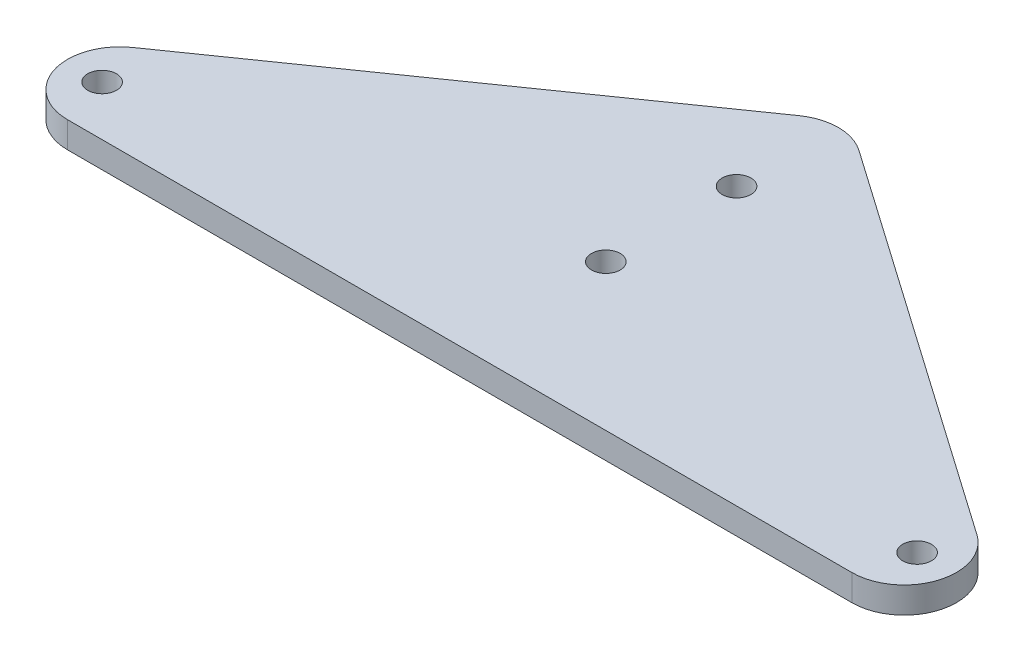
ISO-10303-21;
HEADER;
FILE_DESCRIPTION(('STEP AP214'),'2;1');
FILE_NAME('part.step','',(''),(''),'','','');
FILE_SCHEMA(('AUTOMOTIVE_DESIGN { 1 0 10303 214 1 1 1 1 }'));
ENDSEC;
DATA;
#1=APPLICATION_CONTEXT('core data for automotive mechanical design processes');
#2=APPLICATION_PROTOCOL_DEFINITION('international standard','automotive_design',2000,#1);
#3=PRODUCT_CONTEXT('',#1,'mechanical');
#4=PRODUCT('Part','Part','',(#3));
#5=PRODUCT_RELATED_PRODUCT_CATEGORY('part','',(#4));
#6=PRODUCT_DEFINITION_FORMATION('','',#4);
#7=PRODUCT_DEFINITION_CONTEXT('part definition',#1,'design');
#8=PRODUCT_DEFINITION('design','',#6,#7);
#9=PRODUCT_DEFINITION_SHAPE('','',#8);
#10=(LENGTH_UNIT() NAMED_UNIT(*) SI_UNIT(.MILLI.,.METRE.));
#11=(NAMED_UNIT(*) PLANE_ANGLE_UNIT() SI_UNIT($,.RADIAN.));
#12=(NAMED_UNIT(*) SI_UNIT($,.STERADIAN.) SOLID_ANGLE_UNIT());
#13=UNCERTAINTY_MEASURE_WITH_UNIT(LENGTH_MEASURE(1.E-05),#10,'distance_accuracy_value','');
#14=(GEOMETRIC_REPRESENTATION_CONTEXT(3) GLOBAL_UNCERTAINTY_ASSIGNED_CONTEXT((#13)) GLOBAL_UNIT_ASSIGNED_CONTEXT((#10,
#11,#12)) REPRESENTATION_CONTEXT('',''));
#15=CARTESIAN_POINT('',(0.,0.,0.));
#16=DIRECTION('',(0.,0.,1.));
#17=DIRECTION('',(1.,0.,0.));
#18=AXIS2_PLACEMENT_3D('',#15,#16,#17);
#19=CARTESIAN_POINT('',(75.,5.,-2.04927415816925));
#20=DIRECTION('',(0.,-1.,0.));
#21=DIRECTION('',(0.,0.,-1.));
#22=AXIS2_PLACEMENT_3D('',#19,#20,#21);
#23=CYLINDRICAL_SURFACE('',#22,10.);
#24=CARTESIAN_POINT('',(75.,0.,-2.04927415816925));
#25=DIRECTION('',(0.,1.,0.));
#26=DIRECTION('',(0.,0.,1.));
#27=AXIS2_PLACEMENT_3D('',#24,#25,#26);
#28=CIRCLE('',#27,10.);
#29=CARTESIAN_POINT('',(75.,0.,7.95072584183075));
#30=VERTEX_POINT('',#29);
#31=CARTESIAN_POINT('',(80.728613730277,0.,-10.2457968799874));
#32=VERTEX_POINT('',#31);
#33=EDGE_CURVE('E125',#30,#32,#28,.T.);
#34=ORIENTED_EDGE('',*,*,#33,.T.);
#35=DIRECTION('',(0.,-1.,0.));
#36=VECTOR('',#35,1.);
#37=CARTESIAN_POINT('',(80.728613730277,5.,-10.2457968799874));
#38=LINE('',#37,#36);
#39=CARTESIAN_POINT('',(80.728613730277,5.,-10.2457968799874));
#40=VERTEX_POINT('',#39);
#41=EDGE_CURVE('E11',#40,#32,#38,.T.);
#42=ORIENTED_EDGE('',*,*,#41,.F.);
#43=CARTESIAN_POINT('',(75.,5.,-2.04927415816925));
#44=DIRECTION('',(0.,1.,0.));
#45=DIRECTION('',(0.,0.,1.));
#46=AXIS2_PLACEMENT_3D('',#43,#44,#45);
#47=CIRCLE('',#46,10.);
#48=CARTESIAN_POINT('',(75.,5.,7.95072584183075));
#49=VERTEX_POINT('',#48);
#50=EDGE_CURVE('E136',#49,#40,#47,.T.);
#51=ORIENTED_EDGE('',*,*,#50,.F.);
#52=DIRECTION('',(0.,-1.,0.));
#53=VECTOR('',#52,1.);
#54=CARTESIAN_POINT('',(75.,5.,7.95072584183075));
#55=LINE('',#54,#53);
#56=EDGE_CURVE('E121',#49,#30,#55,.T.);
#57=ORIENTED_EDGE('',*,*,#56,.T.);
#58=EDGE_LOOP('',(#34,#42,#51,#57));
#59=FACE_BOUND('',#58,.T.);
#60=ADVANCED_FACE('F41',(#59),#23,.T.);
#61=CARTESIAN_POINT('',(80.728613730277,5.,-10.2457968799874));
#62=DIRECTION('',(-0.572861373027704,0.,0.819652272181816));
#63=DIRECTION('',(0.819652272181816,0.,0.572861373027704));
#64=AXIS2_PLACEMENT_3D('',#61,#62,#63);
#65=PLANE('',#64);
#66=DIRECTION('',(-0.819652272181816,0.,-0.572861373027704));
#67=VECTOR('',#66,1.);
#68=CARTESIAN_POINT('',(80.728613730277,0.,-10.2457968799874));
#69=LINE('',#68,#67);
#70=CARTESIAN_POINT('',(5.72861373027705,0.,-62.6638824941604));
#71=VERTEX_POINT('',#70);
#72=EDGE_CURVE('E128',#32,#71,#69,.T.);
#73=ORIENTED_EDGE('',*,*,#72,.T.);
#74=DIRECTION('',(0.,-1.,0.));
#75=VECTOR('',#74,1.);
#76=CARTESIAN_POINT('',(5.72861373027705,5.,-62.6638824941604));
#77=LINE('',#76,#75);
#78=CARTESIAN_POINT('',(5.72861373027705,5.,-62.6638824941604));
#79=VERTEX_POINT('',#78);
#80=EDGE_CURVE('E49',#79,#71,#77,.T.);
#81=ORIENTED_EDGE('',*,*,#80,.F.);
#82=DIRECTION('',(-0.819652272181816,0.,-0.572861373027704));
#83=VECTOR('',#82,1.);
#84=CARTESIAN_POINT('',(80.728613730277,5.,-10.2457968799874));
#85=LINE('',#84,#83);
#86=EDGE_CURVE('E94',#40,#79,#85,.T.);
#87=ORIENTED_EDGE('',*,*,#86,.F.);
#88=ORIENTED_EDGE('',*,*,#41,.T.);
#89=EDGE_LOOP('',(#73,#81,#87,#88));
#90=FACE_BOUND('',#89,.T.);
#91=ADVANCED_FACE('F161',(#90),#65,.F.);
#92=CARTESIAN_POINT('',(0.,5.,-54.4673597723422));
#93=DIRECTION('',(0.,-1.,0.));
#94=DIRECTION('',(0.,0.,-1.));
#95=AXIS2_PLACEMENT_3D('',#92,#93,#94);
#96=CYLINDRICAL_SURFACE('',#95,10.);
#97=CARTESIAN_POINT('',(0.,0.,-54.4673597723422));
#98=DIRECTION('',(0.,1.,0.));
#99=DIRECTION('',(0.,0.,-1.));
#100=AXIS2_PLACEMENT_3D('',#97,#98,#99);
#101=CIRCLE('',#100,10.);
#102=CARTESIAN_POINT('',(-5.72861373027705,0.,-62.6638824941604));
#103=VERTEX_POINT('',#102);
#104=EDGE_CURVE('E131',#71,#103,#101,.T.);
#105=ORIENTED_EDGE('',*,*,#104,.T.);
#106=DIRECTION('',(0.,-1.,0.));
#107=VECTOR('',#106,1.);
#108=CARTESIAN_POINT('',(-5.72861373027705,5.,-62.6638824941604));
#109=LINE('',#108,#107);
#110=CARTESIAN_POINT('',(-5.72861373027705,5.,-62.6638824941604));
#111=VERTEX_POINT('',#110);
#112=EDGE_CURVE('E116',#111,#103,#109,.T.);
#113=ORIENTED_EDGE('',*,*,#112,.F.);
#114=CARTESIAN_POINT('',(0.,5.,-54.4673597723422));
#115=DIRECTION('',(0.,1.,0.));
#116=DIRECTION('',(0.,0.,-1.));
#117=AXIS2_PLACEMENT_3D('',#114,#115,#116);
#118=CIRCLE('',#117,10.);
#119=EDGE_CURVE('E107',#79,#111,#118,.T.);
#120=ORIENTED_EDGE('',*,*,#119,.F.);
#121=ORIENTED_EDGE('',*,*,#80,.T.);
#122=EDGE_LOOP('',(#105,#113,#120,#121));
#123=FACE_BOUND('',#122,.T.);
#124=ADVANCED_FACE('F142',(#123),#96,.T.);
#125=CARTESIAN_POINT('',(-5.72861373027705,5.,-62.6638824941604));
#126=DIRECTION('',(0.572861373027704,0.,0.819652272181816));
#127=DIRECTION('',(0.819652272181816,0.,-0.572861373027704));
#128=AXIS2_PLACEMENT_3D('',#125,#126,#127);
#129=PLANE('',#128);
#130=DIRECTION('',(-0.819652272181816,0.,0.572861373027704));
#131=VECTOR('',#130,1.);
#132=CARTESIAN_POINT('',(-5.72861373027705,0.,-62.6638824941604));
#133=LINE('',#132,#131);
#134=CARTESIAN_POINT('',(-80.728613730277,0.,-10.2457968799874));
#135=VERTEX_POINT('',#134);
#136=EDGE_CURVE('E115',#103,#135,#133,.T.);
#137=ORIENTED_EDGE('',*,*,#136,.T.);
#138=DIRECTION('',(0.,-1.,0.));
#139=VECTOR('',#138,1.);
#140=CARTESIAN_POINT('',(-80.728613730277,5.,-10.2457968799874));
#141=LINE('',#140,#139);
#142=CARTESIAN_POINT('',(-80.728613730277,5.,-10.2457968799874));
#143=VERTEX_POINT('',#142);
#144=EDGE_CURVE('E112',#143,#135,#141,.T.);
#145=ORIENTED_EDGE('',*,*,#144,.F.);
#146=DIRECTION('',(-0.819652272181816,0.,0.572861373027704));
#147=VECTOR('',#146,1.);
#148=CARTESIAN_POINT('',(-5.72861373027705,5.,-62.6638824941604));
#149=LINE('',#148,#147);
#150=EDGE_CURVE('E101',#111,#143,#149,.T.);
#151=ORIENTED_EDGE('',*,*,#150,.F.);
#152=ORIENTED_EDGE('',*,*,#112,.T.);
#153=EDGE_LOOP('',(#137,#145,#151,#152));
#154=FACE_BOUND('',#153,.T.);
#155=ADVANCED_FACE('F113',(#154),#129,.F.);
#156=CARTESIAN_POINT('',(-75.,5.,-2.04927415816923));
#157=DIRECTION('',(0.,-1.,0.));
#158=DIRECTION('',(0.,0.,-1.));
#159=AXIS2_PLACEMENT_3D('',#156,#157,#158);
#160=CYLINDRICAL_SURFACE('',#159,10.);
#161=CARTESIAN_POINT('',(-75.,0.,-2.04927415816923));
#162=DIRECTION('',(0.,1.,0.));
#163=DIRECTION('',(0.,0.,1.));
#164=AXIS2_PLACEMENT_3D('',#161,#162,#163);
#165=CIRCLE('',#164,10.);
#166=CARTESIAN_POINT('',(-75.,0.,7.95072584183077));
#167=VERTEX_POINT('',#166);
#168=EDGE_CURVE('E80',#135,#167,#165,.T.);
#169=ORIENTED_EDGE('',*,*,#168,.T.);
#170=DIRECTION('',(0.,-1.,0.));
#171=VECTOR('',#170,1.);
#172=CARTESIAN_POINT('',(-75.,5.,7.95072584183077));
#173=LINE('',#172,#171);
#174=CARTESIAN_POINT('',(-75.,5.,7.95072584183077));
#175=VERTEX_POINT('',#174);
#176=EDGE_CURVE('E117',#175,#167,#173,.T.);
#177=ORIENTED_EDGE('',*,*,#176,.F.);
#178=CARTESIAN_POINT('',(-75.,5.,-2.04927415816923));
#179=DIRECTION('',(0.,1.,0.));
#180=DIRECTION('',(0.,0.,1.));
#181=AXIS2_PLACEMENT_3D('',#178,#179,#180);
#182=CIRCLE('',#181,10.);
#183=EDGE_CURVE('E105',#143,#175,#182,.T.);
#184=ORIENTED_EDGE('',*,*,#183,.F.);
#185=ORIENTED_EDGE('',*,*,#144,.T.);
#186=EDGE_LOOP('',(#169,#177,#184,#185));
#187=FACE_BOUND('',#186,.T.);
#188=ADVANCED_FACE('F119',(#187),#160,.T.);
#189=CARTESIAN_POINT('',(-75.,5.,7.95072584183077));
#190=DIRECTION('',(0.,0.,-1.));
#191=DIRECTION('',(-1.,0.,0.));
#192=AXIS2_PLACEMENT_3D('',#189,#190,#191);
#193=PLANE('',#192);
#194=DIRECTION('',(1.,0.,0.));
#195=VECTOR('',#194,1.);
#196=CARTESIAN_POINT('',(-75.,0.,7.95072584183077));
#197=LINE('',#196,#195);
#198=EDGE_CURVE('E86',#167,#30,#197,.T.);
#199=ORIENTED_EDGE('',*,*,#198,.T.);
#200=ORIENTED_EDGE('',*,*,#56,.F.);
#201=DIRECTION('',(1.,0.,0.));
#202=VECTOR('',#201,1.);
#203=CARTESIAN_POINT('',(-75.,5.,7.95072584183077));
#204=LINE('',#203,#202);
#205=EDGE_CURVE('E57',#175,#49,#204,.T.);
#206=ORIENTED_EDGE('',*,*,#205,.F.);
#207=ORIENTED_EDGE('',*,*,#176,.T.);
#208=EDGE_LOOP('',(#199,#200,#206,#207));
#209=FACE_BOUND('',#208,.T.);
#210=ADVANCED_FACE('F149',(#209),#193,.F.);
#211=CARTESIAN_POINT('',(75.,5.,-2.04927415816925));
#212=DIRECTION('',(0.,1.,0.));
#213=DIRECTION('',(0.,0.,1.));
#214=AXIS2_PLACEMENT_3D('',#211,#212,#213);
#215=PLANE('',#214);
#216=CARTESIAN_POINT('',(77.9289159969783,5.,-1.58750543105869));
#217=DIRECTION('',(0.,1.,0.));
#218=DIRECTION('',(0.,0.,1.));
#219=AXIS2_PLACEMENT_3D('',#216,#217,#218);
#220=CIRCLE('',#219,2.74999999999999);
#221=CARTESIAN_POINT('',(77.9289159969783,5.,1.1624945689413));
#222=VERTEX_POINT('',#221);
#223=EDGE_CURVE('E285',#222,#222,#220,.T.);
#224=ORIENTED_EDGE('',*,*,#223,.F.);
#225=EDGE_LOOP('',(#224));
#226=FACE_BOUND('',#225,.T.);
#227=CARTESIAN_POINT('',(-77.9289159969783,5.,-1.58750543105869));
#228=DIRECTION('',(0.,1.,0.));
#229=DIRECTION('',(0.,0.,1.));
#230=AXIS2_PLACEMENT_3D('',#227,#228,#229);
#231=CIRCLE('',#230,2.74999999999999);
#232=CARTESIAN_POINT('',(-77.9289159969783,5.,1.1624945689413));
#233=VERTEX_POINT('',#232);
#234=EDGE_CURVE('E287',#233,#233,#231,.T.);
#235=ORIENTED_EDGE('',*,*,#234,.F.);
#236=EDGE_LOOP('',(#235));
#237=FACE_BOUND('',#236,.T.);
#238=CARTESIAN_POINT('',(0.,5.,-45.));
#239=DIRECTION('',(0.,1.,0.));
#240=DIRECTION('',(0.,0.,1.));
#241=AXIS2_PLACEMENT_3D('',#238,#239,#240);
#242=CIRCLE('',#241,2.74999999999999);
#243=CARTESIAN_POINT('',(0.,5.,-42.25));
#244=VERTEX_POINT('',#243);
#245=EDGE_CURVE('E295',#244,#244,#242,.T.);
#246=ORIENTED_EDGE('',*,*,#245,.F.);
#247=EDGE_LOOP('',(#246));
#248=FACE_BOUND('',#247,.T.);
#249=CARTESIAN_POINT('',(0.,5.,-20.));
#250=DIRECTION('',(0.,1.,0.));
#251=DIRECTION('',(0.,0.,1.));
#252=AXIS2_PLACEMENT_3D('',#249,#250,#251);
#253=CIRCLE('',#252,2.74999999999999);
#254=CARTESIAN_POINT('',(0.,5.,-17.25));
#255=VERTEX_POINT('',#254);
#256=EDGE_CURVE('E301',#255,#255,#253,.T.);
#257=ORIENTED_EDGE('',*,*,#256,.F.);
#258=EDGE_LOOP('',(#257));
#259=FACE_BOUND('',#258,.T.);
#260=ORIENTED_EDGE('',*,*,#50,.T.);
#261=ORIENTED_EDGE('',*,*,#86,.T.);
#262=ORIENTED_EDGE('',*,*,#119,.T.);
#263=ORIENTED_EDGE('',*,*,#150,.T.);
#264=ORIENTED_EDGE('',*,*,#183,.T.);
#265=ORIENTED_EDGE('',*,*,#205,.T.);
#266=EDGE_LOOP('',(#260,#261,#262,#263,#264,#265));
#267=FACE_BOUND('',#266,.T.);
#268=ADVANCED_FACE('F103',(#226,#237,#248,#259,#267),#215,.T.);
#269=CARTESIAN_POINT('',(75.,0.,-2.04927415816925));
#270=DIRECTION('',(0.,1.,0.));
#271=DIRECTION('',(0.,0.,1.));
#272=AXIS2_PLACEMENT_3D('',#269,#270,#271);
#273=PLANE('',#272);
#274=CARTESIAN_POINT('',(77.9289159969783,0.,-1.58750543105869));
#275=DIRECTION('',(0.,1.,0.));
#276=DIRECTION('',(0.,0.,1.));
#277=AXIS2_PLACEMENT_3D('',#274,#275,#276);
#278=CIRCLE('',#277,2.75);
#279=CARTESIAN_POINT('',(77.9289159969783,0.,1.16249456894132));
#280=VERTEX_POINT('',#279);
#281=EDGE_CURVE('E282',#280,#280,#278,.T.);
#282=ORIENTED_EDGE('',*,*,#281,.T.);
#283=EDGE_LOOP('',(#282));
#284=FACE_BOUND('',#283,.T.);
#285=CARTESIAN_POINT('',(-77.9289159969783,0.,-1.58750543105869));
#286=DIRECTION('',(0.,1.,0.));
#287=DIRECTION('',(0.,0.,1.));
#288=AXIS2_PLACEMENT_3D('',#285,#286,#287);
#289=CIRCLE('',#288,2.75);
#290=CARTESIAN_POINT('',(-77.9289159969783,0.,1.16249456894132));
#291=VERTEX_POINT('',#290);
#292=EDGE_CURVE('E292',#291,#291,#289,.T.);
#293=ORIENTED_EDGE('',*,*,#292,.T.);
#294=EDGE_LOOP('',(#293));
#295=FACE_BOUND('',#294,.T.);
#296=CARTESIAN_POINT('',(0.,0.,-45.));
#297=DIRECTION('',(0.,1.,0.));
#298=DIRECTION('',(0.,0.,1.));
#299=AXIS2_PLACEMENT_3D('',#296,#297,#298);
#300=CIRCLE('',#299,2.75);
#301=CARTESIAN_POINT('',(0.,0.,-42.25));
#302=VERTEX_POINT('',#301);
#303=EDGE_CURVE('E298',#302,#302,#300,.T.);
#304=ORIENTED_EDGE('',*,*,#303,.T.);
#305=EDGE_LOOP('',(#304));
#306=FACE_BOUND('',#305,.T.);
#307=CARTESIAN_POINT('',(0.,0.,-20.));
#308=DIRECTION('',(0.,1.,0.));
#309=DIRECTION('',(0.,0.,1.));
#310=AXIS2_PLACEMENT_3D('',#307,#308,#309);
#311=CIRCLE('',#310,2.75);
#312=CARTESIAN_POINT('',(0.,0.,-17.25));
#313=VERTEX_POINT('',#312);
#314=EDGE_CURVE('E129',#313,#313,#311,.T.);
#315=ORIENTED_EDGE('',*,*,#314,.T.);
#316=EDGE_LOOP('',(#315));
#317=FACE_BOUND('',#316,.T.);
#318=ORIENTED_EDGE('',*,*,#33,.F.);
#319=ORIENTED_EDGE('',*,*,#198,.F.);
#320=ORIENTED_EDGE('',*,*,#168,.F.);
#321=ORIENTED_EDGE('',*,*,#136,.F.);
#322=ORIENTED_EDGE('',*,*,#104,.F.);
#323=ORIENTED_EDGE('',*,*,#72,.F.);
#324=EDGE_LOOP('',(#318,#319,#320,#321,#322,#323));
#325=FACE_BOUND('',#324,.T.);
#326=ADVANCED_FACE('F145',(#284,#295,#306,#317,#325),#273,.F.);
#327=CARTESIAN_POINT('',(0.,5.,-20.));
#328=DIRECTION('',(0.,1.,0.));
#329=DIRECTION('',(0.,0.,1.));
#330=AXIS2_PLACEMENT_3D('',#327,#328,#329);
#331=CYLINDRICAL_SURFACE('',#330,2.74999999999999);
#332=ORIENTED_EDGE('',*,*,#314,.F.);
#333=EDGE_LOOP('',(#332));
#334=FACE_BOUND('',#333,.T.);
#335=ORIENTED_EDGE('',*,*,#256,.T.);
#336=EDGE_LOOP('',(#335));
#337=FACE_BOUND('',#336,.T.);
#338=ADVANCED_FACE('F191',(#334,#337),#331,.F.);
#339=CARTESIAN_POINT('',(0.,5.,-45.));
#340=DIRECTION('',(0.,1.,0.));
#341=DIRECTION('',(0.,0.,1.));
#342=AXIS2_PLACEMENT_3D('',#339,#340,#341);
#343=CYLINDRICAL_SURFACE('',#342,2.74999999999999);
#344=ORIENTED_EDGE('',*,*,#303,.F.);
#345=EDGE_LOOP('',(#344));
#346=FACE_BOUND('',#345,.T.);
#347=ORIENTED_EDGE('',*,*,#245,.T.);
#348=EDGE_LOOP('',(#347));
#349=FACE_BOUND('',#348,.T.);
#350=ADVANCED_FACE('F196',(#346,#349),#343,.F.);
#351=CARTESIAN_POINT('',(-77.9289159969783,5.,-1.58750543105869));
#352=DIRECTION('',(0.,1.,0.));
#353=DIRECTION('',(0.,0.,1.));
#354=AXIS2_PLACEMENT_3D('',#351,#352,#353);
#355=CYLINDRICAL_SURFACE('',#354,2.75);
#356=ORIENTED_EDGE('',*,*,#292,.F.);
#357=EDGE_LOOP('',(#356));
#358=FACE_BOUND('',#357,.T.);
#359=ORIENTED_EDGE('',*,*,#234,.T.);
#360=EDGE_LOOP('',(#359));
#361=FACE_BOUND('',#360,.T.);
#362=ADVANCED_FACE('F209',(#358,#361),#355,.F.);
#363=CARTESIAN_POINT('',(77.9289159969783,5.,-1.58750543105869));
#364=DIRECTION('',(0.,1.,0.));
#365=DIRECTION('',(0.,0.,1.));
#366=AXIS2_PLACEMENT_3D('',#363,#364,#365);
#367=CYLINDRICAL_SURFACE('',#366,2.75);
#368=ORIENTED_EDGE('',*,*,#281,.F.);
#369=EDGE_LOOP('',(#368));
#370=FACE_BOUND('',#369,.T.);
#371=ORIENTED_EDGE('',*,*,#223,.T.);
#372=EDGE_LOOP('',(#371));
#373=FACE_BOUND('',#372,.T.);
#374=ADVANCED_FACE('F220',(#370,#373),#367,.F.);
#375=CLOSED_SHELL('',(#60,#91,#124,#155,#188,#210,#268,#326,#338,#350,#362,#374));
#376=MANIFOLD_SOLID_BREP('B2',#375);
#377=ADVANCED_BREP_SHAPE_REPRESENTATION('',(#18,#376),#14);
#378=SHAPE_DEFINITION_REPRESENTATION(#9,#377);
ENDSEC;
END-ISO-10303-21;
